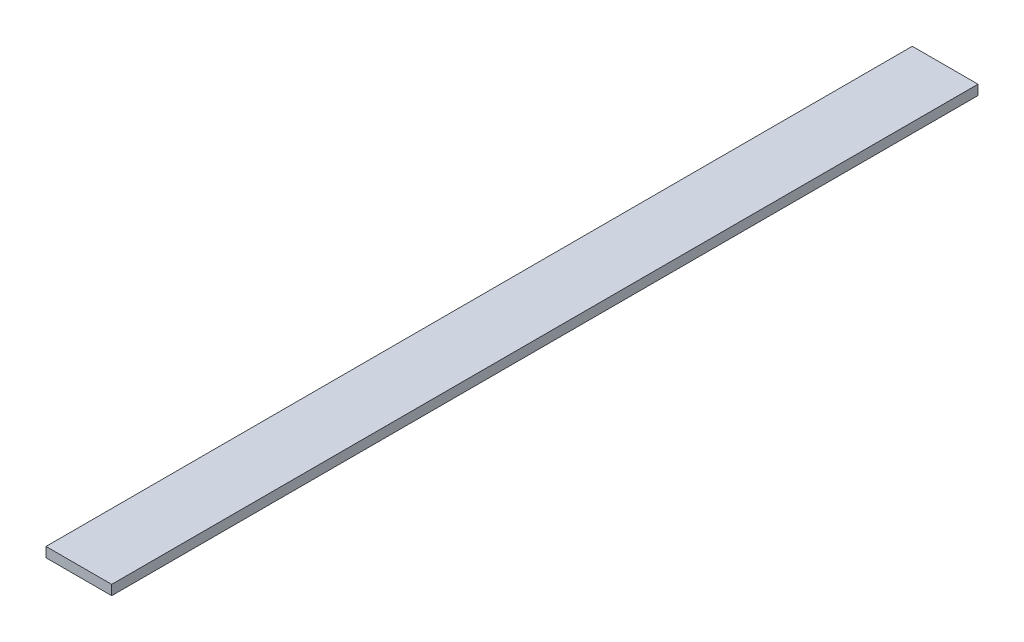
ISO-10303-21;
HEADER;
FILE_DESCRIPTION(('STEP AP214'),'2;1');
FILE_NAME('part.step','',(''),(''),'','','');
FILE_SCHEMA(('AUTOMOTIVE_DESIGN { 1 0 10303 214 1 1 1 1 }'));
ENDSEC;
DATA;
#1=APPLICATION_CONTEXT('core data for automotive mechanical design processes');
#2=APPLICATION_PROTOCOL_DEFINITION('international standard','automotive_design',2000,#1);
#3=PRODUCT_CONTEXT('',#1,'mechanical');
#4=PRODUCT('Part','Part','',(#3));
#5=PRODUCT_RELATED_PRODUCT_CATEGORY('part','',(#4));
#6=PRODUCT_DEFINITION_FORMATION('','',#4);
#7=PRODUCT_DEFINITION_CONTEXT('part definition',#1,'design');
#8=PRODUCT_DEFINITION('design','',#6,#7);
#9=PRODUCT_DEFINITION_SHAPE('','',#8);
#10=(LENGTH_UNIT() NAMED_UNIT(*) SI_UNIT(.MILLI.,.METRE.));
#11=(NAMED_UNIT(*) PLANE_ANGLE_UNIT() SI_UNIT($,.RADIAN.));
#12=(NAMED_UNIT(*) SI_UNIT($,.STERADIAN.) SOLID_ANGLE_UNIT());
#13=UNCERTAINTY_MEASURE_WITH_UNIT(LENGTH_MEASURE(1.E-05),#10,'distance_accuracy_value','');
#14=(GEOMETRIC_REPRESENTATION_CONTEXT(3) GLOBAL_UNCERTAINTY_ASSIGNED_CONTEXT((#13)) GLOBAL_UNIT_ASSIGNED_CONTEXT((#10,
#11,#12)) REPRESENTATION_CONTEXT('',''));
#15=CARTESIAN_POINT('',(0.,0.,0.));
#16=DIRECTION('',(0.,0.,1.));
#17=DIRECTION('',(1.,0.,0.));
#18=AXIS2_PLACEMENT_3D('',#15,#16,#17);
#19=CARTESIAN_POINT('',(-6.51612903225794,4.5,-316.756272401434));
#20=DIRECTION('',(-1.,0.,0.));
#21=DIRECTION('',(0.,0.,1.));
#22=AXIS2_PLACEMENT_3D('',#19,#20,#21);
#23=PLANE('',#22);
#24=DIRECTION('',(0.,0.,-1.));
#25=VECTOR('',#24,1.);
#26=CARTESIAN_POINT('',(-6.51612903225794,4.5,-316.756272401434));
#27=LINE('',#26,#25);
#28=CARTESIAN_POINT('',(-6.51612903225794,4.5,78.8737275985663));
#29=VERTEX_POINT('',#28);
#30=CARTESIAN_POINT('',(-6.51612903225794,4.5,-316.756272401434));
#31=VERTEX_POINT('',#30);
#32=EDGE_CURVE('E93',#29,#31,#27,.T.);
#33=ORIENTED_EDGE('',*,*,#32,.F.);
#34=DIRECTION('',(0.,1.,0.));
#35=VECTOR('',#34,1.);
#36=CARTESIAN_POINT('',(-6.51612903225794,4.5,78.8737275985663));
#37=LINE('',#36,#35);
#38=CARTESIAN_POINT('',(-6.51612903225794,0.,78.8737275985663));
#39=VERTEX_POINT('',#38);
#40=EDGE_CURVE('E104',#39,#29,#37,.T.);
#41=ORIENTED_EDGE('',*,*,#40,.F.);
#42=DIRECTION('',(0.,0.,-1.));
#43=VECTOR('',#42,1.);
#44=CARTESIAN_POINT('',(-6.51612903225794,0.,-316.756272401434));
#45=LINE('',#44,#43);
#46=CARTESIAN_POINT('',(-6.51612903225794,0.,-316.756272401434));
#47=VERTEX_POINT('',#46);
#48=EDGE_CURVE('E85',#39,#47,#45,.T.);
#49=ORIENTED_EDGE('',*,*,#48,.T.);
#50=DIRECTION('',(0.,-1.,0.));
#51=VECTOR('',#50,1.);
#52=CARTESIAN_POINT('',(-6.51612903225794,4.5,-316.756272401434));
#53=LINE('',#52,#51);
#54=EDGE_CURVE('E47',#31,#47,#53,.T.);
#55=ORIENTED_EDGE('',*,*,#54,.F.);
#56=EDGE_LOOP('',(#33,#41,#49,#55));
#57=FACE_BOUND('',#56,.T.);
#58=ADVANCED_FACE('F40',(#57),#23,.F.);
#59=CARTESIAN_POINT('',(-36.516129032258,4.5,-316.756272401434));
#60=DIRECTION('',(0.,0.,1.));
#61=DIRECTION('',(1.,0.,0.));
#62=AXIS2_PLACEMENT_3D('',#59,#60,#61);
#63=PLANE('',#62);
#64=DIRECTION('',(-1.,0.,0.));
#65=VECTOR('',#64,1.);
#66=CARTESIAN_POINT('',(-36.516129032258,0.,-316.756272401434));
#67=LINE('',#66,#65);
#68=CARTESIAN_POINT('',(-36.516129032258,0.,-316.756272401434));
#69=VERTEX_POINT('',#68);
#70=EDGE_CURVE('E75',#47,#69,#67,.T.);
#71=ORIENTED_EDGE('',*,*,#70,.T.);
#72=DIRECTION('',(0.,-1.,0.));
#73=VECTOR('',#72,1.);
#74=CARTESIAN_POINT('',(-36.516129032258,4.5,-316.756272401434));
#75=LINE('',#74,#73);
#76=CARTESIAN_POINT('',(-36.516129032258,4.5,-316.756272401434));
#77=VERTEX_POINT('',#76);
#78=EDGE_CURVE('E78',#77,#69,#75,.T.);
#79=ORIENTED_EDGE('',*,*,#78,.F.);
#80=DIRECTION('',(-1.,0.,0.));
#81=VECTOR('',#80,1.);
#82=CARTESIAN_POINT('',(-36.516129032258,4.5,-316.756272401434));
#83=LINE('',#82,#81);
#84=EDGE_CURVE('E62',#31,#77,#83,.T.);
#85=ORIENTED_EDGE('',*,*,#84,.F.);
#86=ORIENTED_EDGE('',*,*,#54,.T.);
#87=EDGE_LOOP('',(#71,#79,#85,#86));
#88=FACE_BOUND('',#87,.T.);
#89=ADVANCED_FACE('F77',(#88),#63,.F.);
#90=CARTESIAN_POINT('',(-36.516129032258,4.5,-316.756272401434));
#91=DIRECTION('',(1.,0.,0.));
#92=DIRECTION('',(0.,0.,-1.));
#93=AXIS2_PLACEMENT_3D('',#90,#91,#92);
#94=PLANE('',#93);
#95=DIRECTION('',(0.,0.,1.));
#96=VECTOR('',#95,1.);
#97=CARTESIAN_POINT('',(-36.516129032258,0.,-316.756272401434));
#98=LINE('',#97,#96);
#99=CARTESIAN_POINT('',(-36.5161290322579,0.,78.8737275985663));
#100=VERTEX_POINT('',#99);
#101=EDGE_CURVE('E84',#69,#100,#98,.T.);
#102=ORIENTED_EDGE('',*,*,#101,.T.);
#103=DIRECTION('',(0.,1.,0.));
#104=VECTOR('',#103,1.);
#105=CARTESIAN_POINT('',(-36.5161290322579,4.5,78.8737275985663));
#106=LINE('',#105,#104);
#107=CARTESIAN_POINT('',(-36.516129032258,4.5,78.8737275985663));
#108=VERTEX_POINT('',#107);
#109=EDGE_CURVE('E54',#100,#108,#106,.T.);
#110=ORIENTED_EDGE('',*,*,#109,.T.);
#111=DIRECTION('',(0.,0.,1.));
#112=VECTOR('',#111,1.);
#113=CARTESIAN_POINT('',(-36.516129032258,4.5,-316.756272401434));
#114=LINE('',#113,#112);
#115=EDGE_CURVE('E90',#77,#108,#114,.T.);
#116=ORIENTED_EDGE('',*,*,#115,.F.);
#117=ORIENTED_EDGE('',*,*,#78,.T.);
#118=EDGE_LOOP('',(#102,#110,#116,#117));
#119=FACE_BOUND('',#118,.T.);
#120=ADVANCED_FACE('F89',(#119),#94,.F.);
#121=CARTESIAN_POINT('',(0.,4.5,0.));
#122=DIRECTION('',(0.,1.,0.));
#123=DIRECTION('',(0.,0.,1.));
#124=AXIS2_PLACEMENT_3D('',#121,#122,#123);
#125=PLANE('',#124);
#126=DIRECTION('',(1.,0.,0.));
#127=VECTOR('',#126,1.);
#128=CARTESIAN_POINT('',(-46.5161290322579,4.5,78.8737275985663));
#129=LINE('',#128,#127);
#130=EDGE_CURVE('E101',#108,#29,#129,.T.);
#131=ORIENTED_EDGE('',*,*,#130,.T.);
#132=ORIENTED_EDGE('',*,*,#32,.T.);
#133=ORIENTED_EDGE('',*,*,#84,.T.);
#134=ORIENTED_EDGE('',*,*,#115,.T.);
#135=EDGE_LOOP('',(#131,#132,#133,#134));
#136=FACE_BOUND('',#135,.T.);
#137=ADVANCED_FACE('F113',(#136),#125,.T.);
#138=CARTESIAN_POINT('',(0.,0.,0.));
#139=DIRECTION('',(0.,1.,0.));
#140=DIRECTION('',(0.,0.,1.));
#141=AXIS2_PLACEMENT_3D('',#138,#139,#140);
#142=PLANE('',#141);
#143=ORIENTED_EDGE('',*,*,#48,.F.);
#144=DIRECTION('',(-1.,0.,0.));
#145=VECTOR('',#144,1.);
#146=CARTESIAN_POINT('',(0.,0.,78.8737275985663));
#147=LINE('',#146,#145);
#148=EDGE_CURVE('E11',#39,#100,#147,.T.);
#149=ORIENTED_EDGE('',*,*,#148,.T.);
#150=ORIENTED_EDGE('',*,*,#101,.F.);
#151=ORIENTED_EDGE('',*,*,#70,.F.);
#152=EDGE_LOOP('',(#143,#149,#150,#151));
#153=FACE_BOUND('',#152,.T.);
#154=ADVANCED_FACE('F92',(#153),#142,.F.);
#155=CARTESIAN_POINT('',(-46.5161290322579,4.5,78.8737275985663));
#156=DIRECTION('',(0.,0.,-1.));
#157=DIRECTION('',(-1.,0.,0.));
#158=AXIS2_PLACEMENT_3D('',#155,#156,#157);
#159=PLANE('',#158);
#160=ORIENTED_EDGE('',*,*,#148,.F.);
#161=ORIENTED_EDGE('',*,*,#40,.T.);
#162=ORIENTED_EDGE('',*,*,#130,.F.);
#163=ORIENTED_EDGE('',*,*,#109,.F.);
#164=EDGE_LOOP('',(#160,#161,#162,#163));
#165=FACE_BOUND('',#164,.T.);
#166=ADVANCED_FACE('F108',(#165),#159,.F.);
#167=CLOSED_SHELL('',(#58,#89,#120,#137,#154,#166));
#168=MANIFOLD_SOLID_BREP('B2',#167);
#169=ADVANCED_BREP_SHAPE_REPRESENTATION('',(#18,#168),#14);
#170=SHAPE_DEFINITION_REPRESENTATION(#9,#169);
ENDSEC;
END-ISO-10303-21;
